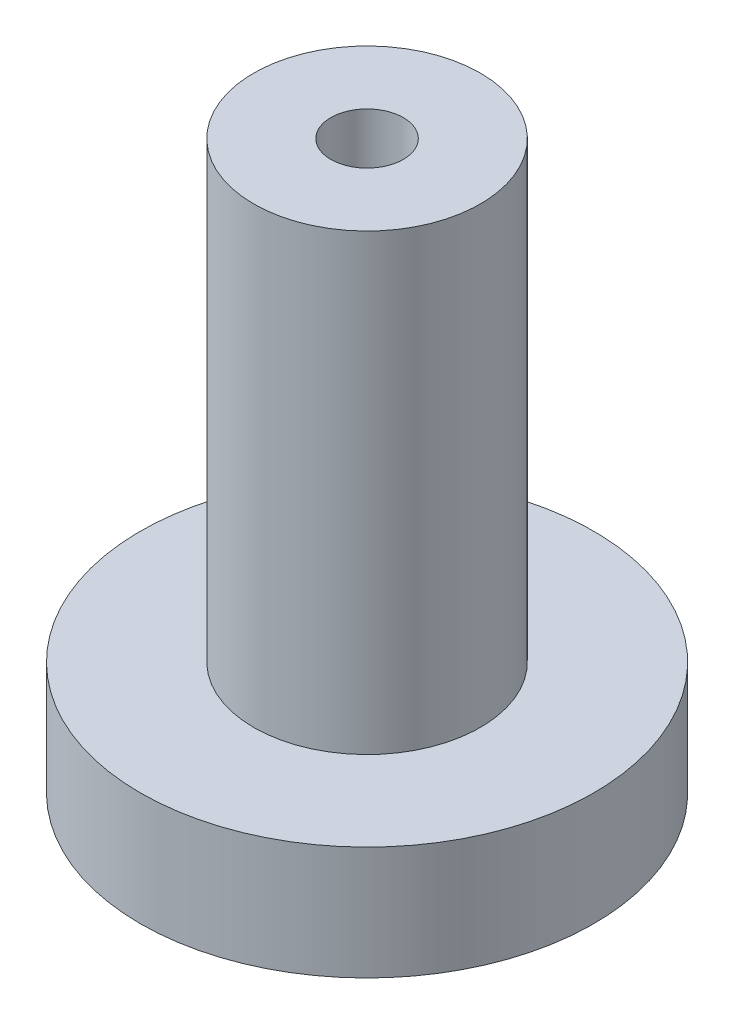
ISO-10303-21;
HEADER;
FILE_DESCRIPTION(('STEP AP214'),'2;1');
FILE_NAME('part.step','',(''),(''),'','','');
FILE_SCHEMA(('AUTOMOTIVE_DESIGN { 1 0 10303 214 1 1 1 1 }'));
ENDSEC;
DATA;
#1=APPLICATION_CONTEXT('core data for automotive mechanical design processes');
#2=APPLICATION_PROTOCOL_DEFINITION('international standard','automotive_design',2000,#1);
#3=PRODUCT_CONTEXT('',#1,'mechanical');
#4=PRODUCT('Part','Part','',(#3));
#5=PRODUCT_RELATED_PRODUCT_CATEGORY('part','',(#4));
#6=PRODUCT_DEFINITION_FORMATION('','',#4);
#7=PRODUCT_DEFINITION_CONTEXT('part definition',#1,'design');
#8=PRODUCT_DEFINITION('design','',#6,#7);
#9=PRODUCT_DEFINITION_SHAPE('','',#8);
#10=(LENGTH_UNIT() NAMED_UNIT(*) SI_UNIT(.MILLI.,.METRE.));
#11=(NAMED_UNIT(*) PLANE_ANGLE_UNIT() SI_UNIT($,.RADIAN.));
#12=(NAMED_UNIT(*) SI_UNIT($,.STERADIAN.) SOLID_ANGLE_UNIT());
#13=UNCERTAINTY_MEASURE_WITH_UNIT(LENGTH_MEASURE(1.E-05),#10,'distance_accuracy_value','');
#14=(GEOMETRIC_REPRESENTATION_CONTEXT(3) GLOBAL_UNCERTAINTY_ASSIGNED_CONTEXT((#13)) GLOBAL_UNIT_ASSIGNED_CONTEXT((#10,
#11,#12)) REPRESENTATION_CONTEXT('',''));
#15=CARTESIAN_POINT('',(0.,0.,0.));
#16=DIRECTION('',(0.,0.,1.));
#17=DIRECTION('',(1.,0.,0.));
#18=AXIS2_PLACEMENT_3D('',#15,#16,#17);
#19=CARTESIAN_POINT('',(0.,6.35,0.));
#20=DIRECTION('',(0.,-1.,0.));
#21=DIRECTION('',(0.,0.,-1.));
#22=AXIS2_PLACEMENT_3D('',#19,#20,#21);
#23=CYLINDRICAL_SURFACE('',#22,12.7);
#24=CARTESIAN_POINT('',(0.,6.35,0.));
#25=DIRECTION('',(0.,1.,0.));
#26=DIRECTION('',(0.,0.,1.));
#27=AXIS2_PLACEMENT_3D('',#24,#25,#26);
#28=CIRCLE('',#27,12.7);
#29=CARTESIAN_POINT('',(0.,6.35,12.7));
#30=VERTEX_POINT('',#29);
#31=EDGE_CURVE('E45',#30,#30,#28,.T.);
#32=ORIENTED_EDGE('',*,*,#31,.F.);
#33=EDGE_LOOP('',(#32));
#34=FACE_BOUND('',#33,.T.);
#35=CARTESIAN_POINT('',(0.,0.,0.));
#36=DIRECTION('',(0.,1.,0.));
#37=DIRECTION('',(0.,0.,1.));
#38=AXIS2_PLACEMENT_3D('',#35,#36,#37);
#39=CIRCLE('',#38,12.7);
#40=CARTESIAN_POINT('',(0.,0.,12.7));
#41=VERTEX_POINT('',#40);
#42=EDGE_CURVE('E40',#41,#41,#39,.T.);
#43=ORIENTED_EDGE('',*,*,#42,.T.);
#44=EDGE_LOOP('',(#43));
#45=FACE_BOUND('',#44,.T.);
#46=ADVANCED_FACE('F37',(#34,#45),#23,.T.);
#47=CARTESIAN_POINT('',(0.,6.35,0.));
#48=DIRECTION('',(0.,1.,0.));
#49=DIRECTION('',(0.,0.,1.));
#50=AXIS2_PLACEMENT_3D('',#47,#48,#49);
#51=PLANE('',#50);
#52=CARTESIAN_POINT('',(0.,6.35,0.));
#53=DIRECTION('',(0.,1.,0.));
#54=DIRECTION('',(0.,0.,1.));
#55=AXIS2_PLACEMENT_3D('',#52,#53,#54);
#56=CIRCLE('',#55,6.35);
#57=CARTESIAN_POINT('',(0.,6.35,6.35));
#58=VERTEX_POINT('',#57);
#59=EDGE_CURVE('E10',#58,#58,#56,.T.);
#60=ORIENTED_EDGE('',*,*,#59,.F.);
#61=EDGE_LOOP('',(#60));
#62=FACE_BOUND('',#61,.T.);
#63=ORIENTED_EDGE('',*,*,#31,.T.);
#64=EDGE_LOOP('',(#63));
#65=FACE_BOUND('',#64,.T.);
#66=ADVANCED_FACE('F86',(#62,#65),#51,.T.);
#67=CARTESIAN_POINT('',(0.,0.,0.));
#68=DIRECTION('',(0.,1.,0.));
#69=DIRECTION('',(0.,0.,1.));
#70=AXIS2_PLACEMENT_3D('',#67,#68,#69);
#71=PLANE('',#70);
#72=ORIENTED_EDGE('',*,*,#42,.F.);
#73=EDGE_LOOP('',(#72));
#74=FACE_BOUND('',#73,.T.);
#75=ADVANCED_FACE('F81',(#74),#71,.F.);
#76=CARTESIAN_POINT('',(0.,31.75,0.));
#77=DIRECTION('',(0.,-1.,0.));
#78=DIRECTION('',(0.,0.,-1.));
#79=AXIS2_PLACEMENT_3D('',#76,#77,#78);
#80=CYLINDRICAL_SURFACE('',#79,6.35);
#81=CARTESIAN_POINT('',(0.,31.75,0.));
#82=DIRECTION('',(0.,1.,0.));
#83=DIRECTION('',(0.,0.,1.));
#84=AXIS2_PLACEMENT_3D('',#81,#82,#83);
#85=CIRCLE('',#84,6.35);
#86=CARTESIAN_POINT('',(0.,31.75,6.35));
#87=VERTEX_POINT('',#86);
#88=EDGE_CURVE('E52',#87,#87,#85,.T.);
#89=ORIENTED_EDGE('',*,*,#88,.F.);
#90=EDGE_LOOP('',(#89));
#91=FACE_BOUND('',#90,.T.);
#92=ORIENTED_EDGE('',*,*,#59,.T.);
#93=EDGE_LOOP('',(#92));
#94=FACE_BOUND('',#93,.T.);
#95=ADVANCED_FACE('F76',(#91,#94),#80,.T.);
#96=CARTESIAN_POINT('',(0.,31.75,0.));
#97=DIRECTION('',(0.,1.,0.));
#98=DIRECTION('',(0.,0.,1.));
#99=AXIS2_PLACEMENT_3D('',#96,#97,#98);
#100=PLANE('',#99);
#101=CARTESIAN_POINT('',(0.,31.75,0.));
#102=DIRECTION('',(0.,1.,0.));
#103=DIRECTION('',(0.,0.,1.));
#104=AXIS2_PLACEMENT_3D('',#101,#102,#103);
#105=CIRCLE('',#104,2.032);
#106=CARTESIAN_POINT('',(0.,31.75,2.032));
#107=VERTEX_POINT('',#106);
#108=EDGE_CURVE('E57',#107,#107,#105,.T.);
#109=ORIENTED_EDGE('',*,*,#108,.F.);
#110=EDGE_LOOP('',(#109));
#111=FACE_BOUND('',#110,.T.);
#112=ORIENTED_EDGE('',*,*,#88,.T.);
#113=EDGE_LOOP('',(#112));
#114=FACE_BOUND('',#113,.T.);
#115=ADVANCED_FACE('F70',(#111,#114),#100,.T.);
#116=CARTESIAN_POINT('',(0.,26.162,0.));
#117=DIRECTION('',(0.,1.,0.));
#118=DIRECTION('',(0.,0.,1.));
#119=AXIS2_PLACEMENT_3D('',#116,#117,#118);
#120=CYLINDRICAL_SURFACE('',#119,2.032);
#121=CARTESIAN_POINT('',(0.,26.162,0.));
#122=DIRECTION('',(0.,1.,0.));
#123=DIRECTION('',(0.,0.,1.));
#124=AXIS2_PLACEMENT_3D('',#121,#122,#123);
#125=CIRCLE('',#124,2.032);
#126=CARTESIAN_POINT('',(0.,26.162,2.032));
#127=VERTEX_POINT('',#126);
#128=EDGE_CURVE('E56',#127,#127,#125,.T.);
#129=ORIENTED_EDGE('',*,*,#128,.F.);
#130=EDGE_LOOP('',(#129));
#131=FACE_BOUND('',#130,.T.);
#132=ORIENTED_EDGE('',*,*,#108,.T.);
#133=EDGE_LOOP('',(#132));
#134=FACE_BOUND('',#133,.T.);
#135=ADVANCED_FACE('F67',(#131,#134),#120,.F.);
#136=CARTESIAN_POINT('',(0.,26.162,0.));
#137=DIRECTION('',(0.,1.,0.));
#138=DIRECTION('',(0.,0.,1.));
#139=AXIS2_PLACEMENT_3D('',#136,#137,#138);
#140=PLANE('',#139);
#141=ORIENTED_EDGE('',*,*,#128,.T.);
#142=EDGE_LOOP('',(#141));
#143=FACE_BOUND('',#142,.T.);
#144=ADVANCED_FACE('F65',(#143),#140,.T.);
#145=CLOSED_SHELL('',(#46,#66,#75,#95,#115,#135,#144));
#146=MANIFOLD_SOLID_BREP('B2',#145);
#147=ADVANCED_BREP_SHAPE_REPRESENTATION('',(#18,#146),#14);
#148=SHAPE_DEFINITION_REPRESENTATION(#9,#147);
ENDSEC;
END-ISO-10303-21;
